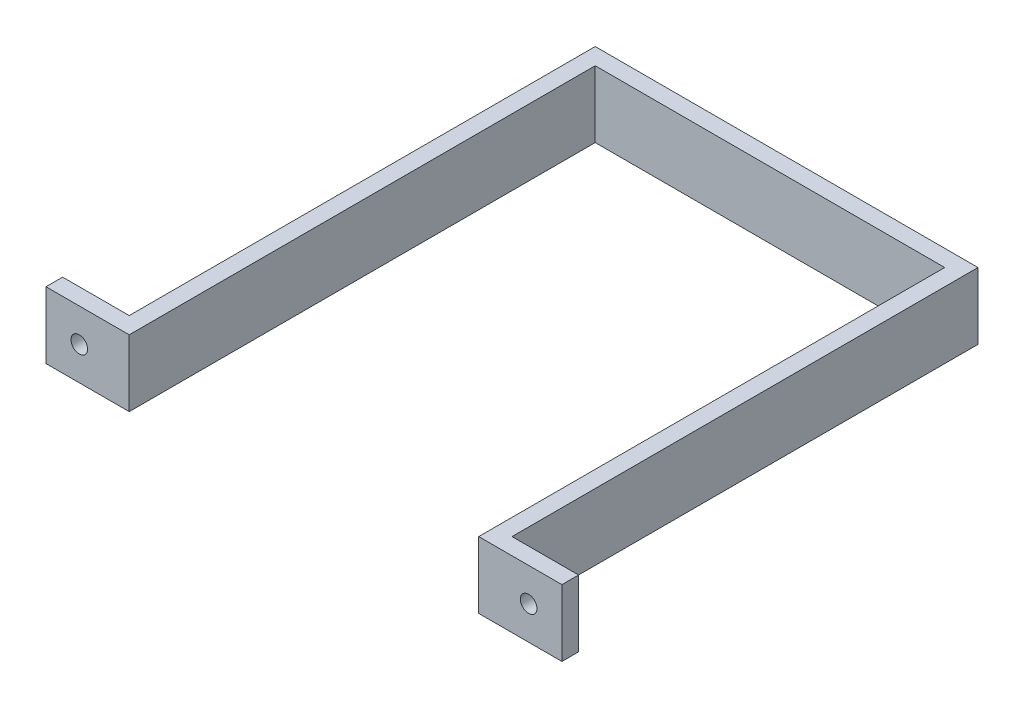
ISO-10303-21;
HEADER;
FILE_DESCRIPTION(('STEP AP214'),'2;1');
FILE_NAME('part.step','',(''),(''),'','','');
FILE_SCHEMA(('AUTOMOTIVE_DESIGN { 1 0 10303 214 1 1 1 1 }'));
ENDSEC;
DATA;
#1=APPLICATION_CONTEXT('core data for automotive mechanical design processes');
#2=APPLICATION_PROTOCOL_DEFINITION('international standard','automotive_design',2000,#1);
#3=PRODUCT_CONTEXT('',#1,'mechanical');
#4=PRODUCT('Part','Part','',(#3));
#5=PRODUCT_RELATED_PRODUCT_CATEGORY('part','',(#4));
#6=PRODUCT_DEFINITION_FORMATION('','',#4);
#7=PRODUCT_DEFINITION_CONTEXT('part definition',#1,'design');
#8=PRODUCT_DEFINITION('design','',#6,#7);
#9=PRODUCT_DEFINITION_SHAPE('','',#8);
#10=(LENGTH_UNIT() NAMED_UNIT(*) SI_UNIT(.MILLI.,.METRE.));
#11=(NAMED_UNIT(*) PLANE_ANGLE_UNIT() SI_UNIT($,.RADIAN.));
#12=(NAMED_UNIT(*) SI_UNIT($,.STERADIAN.) SOLID_ANGLE_UNIT());
#13=UNCERTAINTY_MEASURE_WITH_UNIT(LENGTH_MEASURE(1.E-05),#10,'distance_accuracy_value','');
#14=(GEOMETRIC_REPRESENTATION_CONTEXT(3) GLOBAL_UNCERTAINTY_ASSIGNED_CONTEXT((#13)) GLOBAL_UNIT_ASSIGNED_CONTEXT((#10,
#11,#12)) REPRESENTATION_CONTEXT('',''));
#15=CARTESIAN_POINT('',(0.,0.,0.));
#16=DIRECTION('',(0.,0.,1.));
#17=DIRECTION('',(1.,0.,0.));
#18=AXIS2_PLACEMENT_3D('',#15,#16,#17);
#19=CARTESIAN_POINT('',(0.,20.,70.));
#20=DIRECTION('',(0.,0.,-1.));
#21=DIRECTION('',(-1.,0.,0.));
#22=AXIS2_PLACEMENT_3D('',#19,#20,#21);
#23=PLANE('',#22);
#24=CARTESIAN_POINT('',(67.5,10.,70.));
#25=DIRECTION('',(0.,0.,-1.));
#26=DIRECTION('',(-1.,0.,0.));
#27=AXIS2_PLACEMENT_3D('',#24,#25,#26);
#28=CIRCLE('',#27,2.5);
#29=CARTESIAN_POINT('',(65.,10.,70.));
#30=VERTEX_POINT('',#29);
#31=EDGE_CURVE('E173',#30,#30,#28,.T.);
#32=ORIENTED_EDGE('',*,*,#31,.T.);
#33=EDGE_LOOP('',(#32));
#34=FACE_BOUND('',#33,.T.);
#35=DIRECTION('',(1.,0.,0.));
#36=VECTOR('',#35,1.);
#37=CARTESIAN_POINT('',(0.,0.,70.));
#38=LINE('',#37,#36);
#39=CARTESIAN_POINT('',(52.5,0.,70.));
#40=VERTEX_POINT('',#39);
#41=CARTESIAN_POINT('',(77.5,0.,70.));
#42=VERTEX_POINT('',#41);
#43=EDGE_CURVE('E168',#40,#42,#38,.T.);
#44=ORIENTED_EDGE('',*,*,#43,.T.);
#45=DIRECTION('',(0.,-1.,0.));
#46=VECTOR('',#45,1.);
#47=CARTESIAN_POINT('',(77.5,20.,70.));
#48=LINE('',#47,#46);
#49=CARTESIAN_POINT('',(77.5,20.,70.));
#50=VERTEX_POINT('',#49);
#51=EDGE_CURVE('E11',#50,#42,#48,.T.);
#52=ORIENTED_EDGE('',*,*,#51,.F.);
#53=DIRECTION('',(1.,0.,0.));
#54=VECTOR('',#53,1.);
#55=CARTESIAN_POINT('',(0.,20.,70.));
#56=LINE('',#55,#54);
#57=CARTESIAN_POINT('',(52.5,20.,70.));
#58=VERTEX_POINT('',#57);
#59=EDGE_CURVE('E211',#58,#50,#56,.T.);
#60=ORIENTED_EDGE('',*,*,#59,.F.);
#61=DIRECTION('',(0.,-1.,0.));
#62=VECTOR('',#61,1.);
#63=CARTESIAN_POINT('',(52.5,20.,70.));
#64=LINE('',#63,#62);
#65=EDGE_CURVE('E167',#58,#40,#64,.T.);
#66=ORIENTED_EDGE('',*,*,#65,.T.);
#67=EDGE_LOOP('',(#44,#52,#60,#66));
#68=FACE_BOUND('',#67,.T.);
#69=ADVANCED_FACE('F39',(#34,#68),#23,.F.);
#70=CARTESIAN_POINT('',(77.5,20.,0.));
#71=DIRECTION('',(-1.,0.,0.));
#72=DIRECTION('',(0.,0.,1.));
#73=AXIS2_PLACEMENT_3D('',#70,#71,#72);
#74=PLANE('',#73);
#75=DIRECTION('',(0.,0.,-1.));
#76=VECTOR('',#75,1.);
#77=CARTESIAN_POINT('',(77.5,0.,0.));
#78=LINE('',#77,#76);
#79=CARTESIAN_POINT('',(77.5,0.,65.));
#80=VERTEX_POINT('',#79);
#81=EDGE_CURVE('E172',#42,#80,#78,.T.);
#82=ORIENTED_EDGE('',*,*,#81,.T.);
#83=DIRECTION('',(0.,-1.,0.));
#84=VECTOR('',#83,1.);
#85=CARTESIAN_POINT('',(77.5,20.,65.));
#86=LINE('',#85,#84);
#87=CARTESIAN_POINT('',(77.5,20.,65.));
#88=VERTEX_POINT('',#87);
#89=EDGE_CURVE('E49',#88,#80,#86,.T.);
#90=ORIENTED_EDGE('',*,*,#89,.F.);
#91=DIRECTION('',(0.,0.,-1.));
#92=VECTOR('',#91,1.);
#93=CARTESIAN_POINT('',(77.5,20.,0.));
#94=LINE('',#93,#92);
#95=EDGE_CURVE('E111',#50,#88,#94,.T.);
#96=ORIENTED_EDGE('',*,*,#95,.F.);
#97=ORIENTED_EDGE('',*,*,#51,.T.);
#98=EDGE_LOOP('',(#82,#90,#96,#97));
#99=FACE_BOUND('',#98,.T.);
#100=ADVANCED_FACE('F243',(#99),#74,.F.);
#101=CARTESIAN_POINT('',(0.,20.,65.));
#102=DIRECTION('',(0.,0.,-1.));
#103=DIRECTION('',(-1.,0.,0.));
#104=AXIS2_PLACEMENT_3D('',#101,#102,#103);
#105=PLANE('',#104);
#106=CARTESIAN_POINT('',(67.5,10.,65.));
#107=DIRECTION('',(0.,0.,-1.));
#108=DIRECTION('',(-1.,0.,0.));
#109=AXIS2_PLACEMENT_3D('',#106,#107,#108);
#110=CIRCLE('',#109,2.5);
#111=CARTESIAN_POINT('',(65.,10.,65.));
#112=VERTEX_POINT('',#111);
#113=EDGE_CURVE('E309',#112,#112,#110,.T.);
#114=ORIENTED_EDGE('',*,*,#113,.F.);
#115=EDGE_LOOP('',(#114));
#116=FACE_BOUND('',#115,.T.);
#117=DIRECTION('',(1.,0.,0.));
#118=VECTOR('',#117,1.);
#119=CARTESIAN_POINT('',(0.,0.,65.));
#120=LINE('',#119,#118);
#121=CARTESIAN_POINT('',(57.5,0.,65.));
#122=VERTEX_POINT('',#121);
#123=EDGE_CURVE('E177',#122,#80,#120,.T.);
#124=ORIENTED_EDGE('',*,*,#123,.F.);
#125=DIRECTION('',(0.,-1.,0.));
#126=VECTOR('',#125,1.);
#127=CARTESIAN_POINT('',(57.5,20.,65.));
#128=LINE('',#127,#126);
#129=CARTESIAN_POINT('',(57.5,20.,65.));
#130=VERTEX_POINT('',#129);
#131=EDGE_CURVE('E233',#130,#122,#128,.T.);
#132=ORIENTED_EDGE('',*,*,#131,.F.);
#133=DIRECTION('',(1.,0.,0.));
#134=VECTOR('',#133,1.);
#135=CARTESIAN_POINT('',(0.,20.,65.));
#136=LINE('',#135,#134);
#137=EDGE_CURVE('E242',#130,#88,#136,.T.);
#138=ORIENTED_EDGE('',*,*,#137,.T.);
#139=ORIENTED_EDGE('',*,*,#89,.T.);
#140=EDGE_LOOP('',(#124,#132,#138,#139));
#141=FACE_BOUND('',#140,.T.);
#142=ADVANCED_FACE('F240',(#116,#141),#105,.T.);
#143=CARTESIAN_POINT('',(57.5,20.,0.));
#144=DIRECTION('',(-1.,0.,0.));
#145=DIRECTION('',(0.,0.,1.));
#146=AXIS2_PLACEMENT_3D('',#143,#144,#145);
#147=PLANE('',#146);
#148=DIRECTION('',(0.,0.,-1.));
#149=VECTOR('',#148,1.);
#150=CARTESIAN_POINT('',(57.5,0.,0.));
#151=LINE('',#150,#149);
#152=CARTESIAN_POINT('',(57.5,0.,-75.));
#153=VERTEX_POINT('',#152);
#154=EDGE_CURVE('E181',#122,#153,#151,.T.);
#155=ORIENTED_EDGE('',*,*,#154,.T.);
#156=DIRECTION('',(0.,-1.,0.));
#157=VECTOR('',#156,1.);
#158=CARTESIAN_POINT('',(57.5,20.,-75.));
#159=LINE('',#158,#157);
#160=CARTESIAN_POINT('',(57.5,20.,-75.));
#161=VERTEX_POINT('',#160);
#162=EDGE_CURVE('E230',#161,#153,#159,.T.);
#163=ORIENTED_EDGE('',*,*,#162,.F.);
#164=DIRECTION('',(0.,0.,-1.));
#165=VECTOR('',#164,1.);
#166=CARTESIAN_POINT('',(57.5,20.,0.));
#167=LINE('',#166,#165);
#168=EDGE_CURVE('E255',#130,#161,#167,.T.);
#169=ORIENTED_EDGE('',*,*,#168,.F.);
#170=ORIENTED_EDGE('',*,*,#131,.T.);
#171=EDGE_LOOP('',(#155,#163,#169,#170));
#172=FACE_BOUND('',#171,.T.);
#173=ADVANCED_FACE('F252',(#172),#147,.F.);
#174=CARTESIAN_POINT('',(0.,20.,-75.));
#175=DIRECTION('',(0.,0.,-1.));
#176=DIRECTION('',(-1.,0.,0.));
#177=AXIS2_PLACEMENT_3D('',#174,#175,#176);
#178=PLANE('',#177);
#179=DIRECTION('',(1.,0.,0.));
#180=VECTOR('',#179,1.);
#181=CARTESIAN_POINT('',(0.,0.,-75.));
#182=LINE('',#181,#180);
#183=CARTESIAN_POINT('',(-57.5,0.,-75.));
#184=VERTEX_POINT('',#183);
#185=EDGE_CURVE('E185',#184,#153,#182,.T.);
#186=ORIENTED_EDGE('',*,*,#185,.F.);
#187=DIRECTION('',(0.,-1.,0.));
#188=VECTOR('',#187,1.);
#189=CARTESIAN_POINT('',(-57.5,20.,-75.));
#190=LINE('',#189,#188);
#191=CARTESIAN_POINT('',(-57.5,20.,-75.));
#192=VERTEX_POINT('',#191);
#193=EDGE_CURVE('E227',#192,#184,#190,.T.);
#194=ORIENTED_EDGE('',*,*,#193,.F.);
#195=DIRECTION('',(1.,0.,0.));
#196=VECTOR('',#195,1.);
#197=CARTESIAN_POINT('',(0.,20.,-75.));
#198=LINE('',#197,#196);
#199=EDGE_CURVE('E258',#192,#161,#198,.T.);
#200=ORIENTED_EDGE('',*,*,#199,.T.);
#201=ORIENTED_EDGE('',*,*,#162,.T.);
#202=EDGE_LOOP('',(#186,#194,#200,#201));
#203=FACE_BOUND('',#202,.T.);
#204=ADVANCED_FACE('F327',(#203),#178,.T.);
#205=CARTESIAN_POINT('',(-57.5,20.,0.));
#206=DIRECTION('',(-1.,0.,0.));
#207=DIRECTION('',(0.,0.,1.));
#208=AXIS2_PLACEMENT_3D('',#205,#206,#207);
#209=PLANE('',#208);
#210=DIRECTION('',(0.,0.,-1.));
#211=VECTOR('',#210,1.);
#212=CARTESIAN_POINT('',(-57.5,0.,0.));
#213=LINE('',#212,#211);
#214=CARTESIAN_POINT('',(-57.5,0.,65.));
#215=VERTEX_POINT('',#214);
#216=EDGE_CURVE('E189',#215,#184,#213,.T.);
#217=ORIENTED_EDGE('',*,*,#216,.F.);
#218=DIRECTION('',(0.,-1.,0.));
#219=VECTOR('',#218,1.);
#220=CARTESIAN_POINT('',(-57.5,20.,65.));
#221=LINE('',#220,#219);
#222=CARTESIAN_POINT('',(-57.5,20.,65.));
#223=VERTEX_POINT('',#222);
#224=EDGE_CURVE('E224',#223,#215,#221,.T.);
#225=ORIENTED_EDGE('',*,*,#224,.F.);
#226=DIRECTION('',(0.,0.,-1.));
#227=VECTOR('',#226,1.);
#228=CARTESIAN_POINT('',(-57.5,20.,0.));
#229=LINE('',#228,#227);
#230=EDGE_CURVE('E268',#223,#192,#229,.T.);
#231=ORIENTED_EDGE('',*,*,#230,.T.);
#232=ORIENTED_EDGE('',*,*,#193,.T.);
#233=EDGE_LOOP('',(#217,#225,#231,#232));
#234=FACE_BOUND('',#233,.T.);
#235=ADVANCED_FACE('F332',(#234),#209,.T.);
#236=CARTESIAN_POINT('',(0.,20.,65.));
#237=DIRECTION('',(0.,0.,1.));
#238=DIRECTION('',(1.,0.,0.));
#239=AXIS2_PLACEMENT_3D('',#236,#237,#238);
#240=PLANE('',#239);
#241=CARTESIAN_POINT('',(-67.5,10.,65.));
#242=DIRECTION('',(0.,0.,-1.));
#243=DIRECTION('',(-1.,0.,0.));
#244=AXIS2_PLACEMENT_3D('',#241,#242,#243);
#245=CIRCLE('',#244,2.5);
#246=CARTESIAN_POINT('',(-70.,10.,65.));
#247=VERTEX_POINT('',#246);
#248=EDGE_CURVE('E311',#247,#247,#245,.T.);
#249=ORIENTED_EDGE('',*,*,#248,.F.);
#250=EDGE_LOOP('',(#249));
#251=FACE_BOUND('',#250,.T.);
#252=DIRECTION('',(-1.,0.,0.));
#253=VECTOR('',#252,1.);
#254=CARTESIAN_POINT('',(0.,0.,65.));
#255=LINE('',#254,#253);
#256=CARTESIAN_POINT('',(-77.5,0.,65.));
#257=VERTEX_POINT('',#256);
#258=EDGE_CURVE('E193',#215,#257,#255,.T.);
#259=ORIENTED_EDGE('',*,*,#258,.T.);
#260=DIRECTION('',(0.,-1.,0.));
#261=VECTOR('',#260,1.);
#262=CARTESIAN_POINT('',(-77.5,20.,65.));
#263=LINE('',#262,#261);
#264=CARTESIAN_POINT('',(-77.5,20.,65.));
#265=VERTEX_POINT('',#264);
#266=EDGE_CURVE('E221',#265,#257,#263,.T.);
#267=ORIENTED_EDGE('',*,*,#266,.F.);
#268=DIRECTION('',(-1.,0.,0.));
#269=VECTOR('',#268,1.);
#270=CARTESIAN_POINT('',(0.,20.,65.));
#271=LINE('',#270,#269);
#272=EDGE_CURVE('E272',#223,#265,#271,.T.);
#273=ORIENTED_EDGE('',*,*,#272,.F.);
#274=ORIENTED_EDGE('',*,*,#224,.T.);
#275=EDGE_LOOP('',(#259,#267,#273,#274));
#276=FACE_BOUND('',#275,.T.);
#277=ADVANCED_FACE('F336',(#251,#276),#240,.F.);
#278=CARTESIAN_POINT('',(-77.5,20.,0.));
#279=DIRECTION('',(-1.,0.,0.));
#280=DIRECTION('',(0.,0.,1.));
#281=AXIS2_PLACEMENT_3D('',#278,#279,#280);
#282=PLANE('',#281);
#283=DIRECTION('',(0.,0.,-1.));
#284=VECTOR('',#283,1.);
#285=CARTESIAN_POINT('',(-77.5,0.,0.));
#286=LINE('',#285,#284);
#287=CARTESIAN_POINT('',(-77.5,0.,70.));
#288=VERTEX_POINT('',#287);
#289=EDGE_CURVE('E197',#288,#257,#286,.T.);
#290=ORIENTED_EDGE('',*,*,#289,.F.);
#291=DIRECTION('',(0.,-1.,0.));
#292=VECTOR('',#291,1.);
#293=CARTESIAN_POINT('',(-77.5,20.,70.));
#294=LINE('',#293,#292);
#295=CARTESIAN_POINT('',(-77.5,20.,70.));
#296=VERTEX_POINT('',#295);
#297=EDGE_CURVE('E218',#296,#288,#294,.T.);
#298=ORIENTED_EDGE('',*,*,#297,.F.);
#299=DIRECTION('',(0.,0.,-1.));
#300=VECTOR('',#299,1.);
#301=CARTESIAN_POINT('',(-77.5,20.,0.));
#302=LINE('',#301,#300);
#303=EDGE_CURVE('E161',#296,#265,#302,.T.);
#304=ORIENTED_EDGE('',*,*,#303,.T.);
#305=ORIENTED_EDGE('',*,*,#266,.T.);
#306=EDGE_LOOP('',(#290,#298,#304,#305));
#307=FACE_BOUND('',#306,.T.);
#308=ADVANCED_FACE('F278',(#307),#282,.T.);
#309=CARTESIAN_POINT('',(0.,20.,70.));
#310=DIRECTION('',(0.,0.,1.));
#311=DIRECTION('',(1.,0.,0.));
#312=AXIS2_PLACEMENT_3D('',#309,#310,#311);
#313=PLANE('',#312);
#314=CARTESIAN_POINT('',(-67.5,10.,70.));
#315=DIRECTION('',(0.,0.,1.));
#316=DIRECTION('',(1.,0.,0.));
#317=AXIS2_PLACEMENT_3D('',#314,#315,#316);
#318=CIRCLE('',#317,2.5);
#319=CARTESIAN_POINT('',(-65.,10.,70.));
#320=VERTEX_POINT('',#319);
#321=EDGE_CURVE('E42',#320,#320,#318,.T.);
#322=ORIENTED_EDGE('',*,*,#321,.F.);
#323=EDGE_LOOP('',(#322));
#324=FACE_BOUND('',#323,.T.);
#325=DIRECTION('',(-1.,0.,0.));
#326=VECTOR('',#325,1.);
#327=CARTESIAN_POINT('',(0.,0.,70.));
#328=LINE('',#327,#326);
#329=CARTESIAN_POINT('',(-52.5,0.,70.));
#330=VERTEX_POINT('',#329);
#331=EDGE_CURVE('E201',#330,#288,#328,.T.);
#332=ORIENTED_EDGE('',*,*,#331,.F.);
#333=DIRECTION('',(0.,-1.,0.));
#334=VECTOR('',#333,1.);
#335=CARTESIAN_POINT('',(-52.5,20.,70.));
#336=LINE('',#335,#334);
#337=CARTESIAN_POINT('',(-52.5,20.,70.));
#338=VERTEX_POINT('',#337);
#339=EDGE_CURVE('E146',#338,#330,#336,.T.);
#340=ORIENTED_EDGE('',*,*,#339,.F.);
#341=DIRECTION('',(-1.,0.,0.));
#342=VECTOR('',#341,1.);
#343=CARTESIAN_POINT('',(0.,20.,70.));
#344=LINE('',#343,#342);
#345=EDGE_CURVE('E157',#338,#296,#344,.T.);
#346=ORIENTED_EDGE('',*,*,#345,.T.);
#347=ORIENTED_EDGE('',*,*,#297,.T.);
#348=EDGE_LOOP('',(#332,#340,#346,#347));
#349=FACE_BOUND('',#348,.T.);
#350=ADVANCED_FACE('F284',(#324,#349),#313,.T.);
#351=CARTESIAN_POINT('',(-52.5,20.,0.));
#352=DIRECTION('',(1.,0.,0.));
#353=DIRECTION('',(0.,0.,-1.));
#354=AXIS2_PLACEMENT_3D('',#351,#352,#353);
#355=PLANE('',#354);
#356=DIRECTION('',(0.,0.,1.));
#357=VECTOR('',#356,1.);
#358=CARTESIAN_POINT('',(-52.5,0.,0.));
#359=LINE('',#358,#357);
#360=CARTESIAN_POINT('',(-52.5,0.,-70.));
#361=VERTEX_POINT('',#360);
#362=EDGE_CURVE('E144',#361,#330,#359,.T.);
#363=ORIENTED_EDGE('',*,*,#362,.F.);
#364=DIRECTION('',(0.,-1.,0.));
#365=VECTOR('',#364,1.);
#366=CARTESIAN_POINT('',(-52.5,20.,-70.));
#367=LINE('',#366,#365);
#368=CARTESIAN_POINT('',(-52.5,20.,-70.));
#369=VERTEX_POINT('',#368);
#370=EDGE_CURVE('E138',#369,#361,#367,.T.);
#371=ORIENTED_EDGE('',*,*,#370,.F.);
#372=DIRECTION('',(0.,0.,1.));
#373=VECTOR('',#372,1.);
#374=CARTESIAN_POINT('',(-52.5,20.,0.));
#375=LINE('',#374,#373);
#376=EDGE_CURVE('E142',#369,#338,#375,.T.);
#377=ORIENTED_EDGE('',*,*,#376,.T.);
#378=ORIENTED_EDGE('',*,*,#339,.T.);
#379=EDGE_LOOP('',(#363,#371,#377,#378));
#380=FACE_BOUND('',#379,.T.);
#381=ADVANCED_FACE('F140',(#380),#355,.T.);
#382=CARTESIAN_POINT('',(0.,20.,-70.));
#383=DIRECTION('',(0.,0.,-1.));
#384=DIRECTION('',(-1.,0.,0.));
#385=AXIS2_PLACEMENT_3D('',#382,#383,#384);
#386=PLANE('',#385);
#387=DIRECTION('',(1.,0.,0.));
#388=VECTOR('',#387,1.);
#389=CARTESIAN_POINT('',(0.,0.,-70.));
#390=LINE('',#389,#388);
#391=CARTESIAN_POINT('',(52.5,0.,-70.));
#392=VERTEX_POINT('',#391);
#393=EDGE_CURVE('E97',#361,#392,#390,.T.);
#394=ORIENTED_EDGE('',*,*,#393,.T.);
#395=DIRECTION('',(0.,-1.,0.));
#396=VECTOR('',#395,1.);
#397=CARTESIAN_POINT('',(52.5,20.,-70.));
#398=LINE('',#397,#396);
#399=CARTESIAN_POINT('',(52.5,20.,-70.));
#400=VERTEX_POINT('',#399);
#401=EDGE_CURVE('E147',#400,#392,#398,.T.);
#402=ORIENTED_EDGE('',*,*,#401,.F.);
#403=DIRECTION('',(1.,0.,0.));
#404=VECTOR('',#403,1.);
#405=CARTESIAN_POINT('',(0.,20.,-70.));
#406=LINE('',#405,#404);
#407=EDGE_CURVE('E149',#369,#400,#406,.T.);
#408=ORIENTED_EDGE('',*,*,#407,.F.);
#409=ORIENTED_EDGE('',*,*,#370,.T.);
#410=EDGE_LOOP('',(#394,#402,#408,#409));
#411=FACE_BOUND('',#410,.T.);
#412=ADVANCED_FACE('F150',(#411),#386,.F.);
#413=CARTESIAN_POINT('',(52.5,20.,0.));
#414=DIRECTION('',(1.,0.,0.));
#415=DIRECTION('',(0.,0.,-1.));
#416=AXIS2_PLACEMENT_3D('',#413,#414,#415);
#417=PLANE('',#416);
#418=DIRECTION('',(0.,0.,1.));
#419=VECTOR('',#418,1.);
#420=CARTESIAN_POINT('',(52.5,0.,0.));
#421=LINE('',#420,#419);
#422=EDGE_CURVE('E103',#392,#40,#421,.T.);
#423=ORIENTED_EDGE('',*,*,#422,.T.);
#424=ORIENTED_EDGE('',*,*,#65,.F.);
#425=DIRECTION('',(0.,0.,1.));
#426=VECTOR('',#425,1.);
#427=CARTESIAN_POINT('',(52.5,20.,0.));
#428=LINE('',#427,#426);
#429=EDGE_CURVE('E57',#400,#58,#428,.T.);
#430=ORIENTED_EDGE('',*,*,#429,.F.);
#431=ORIENTED_EDGE('',*,*,#401,.T.);
#432=EDGE_LOOP('',(#423,#424,#430,#431));
#433=FACE_BOUND('',#432,.T.);
#434=ADVANCED_FACE('F287',(#433),#417,.F.);
#435=CARTESIAN_POINT('',(0.,20.,0.));
#436=DIRECTION('',(0.,1.,0.));
#437=DIRECTION('',(0.,0.,1.));
#438=AXIS2_PLACEMENT_3D('',#435,#436,#437);
#439=PLANE('',#438);
#440=ORIENTED_EDGE('',*,*,#59,.T.);
#441=ORIENTED_EDGE('',*,*,#95,.T.);
#442=ORIENTED_EDGE('',*,*,#137,.F.);
#443=ORIENTED_EDGE('',*,*,#168,.T.);
#444=ORIENTED_EDGE('',*,*,#199,.F.);
#445=ORIENTED_EDGE('',*,*,#230,.F.);
#446=ORIENTED_EDGE('',*,*,#272,.T.);
#447=ORIENTED_EDGE('',*,*,#303,.F.);
#448=ORIENTED_EDGE('',*,*,#345,.F.);
#449=ORIENTED_EDGE('',*,*,#376,.F.);
#450=ORIENTED_EDGE('',*,*,#407,.T.);
#451=ORIENTED_EDGE('',*,*,#429,.T.);
#452=EDGE_LOOP('',(#440,#441,#442,#443,#444,#445,#446,#447,#448,#449,#450,#451));
#453=FACE_BOUND('',#452,.T.);
#454=ADVANCED_FACE('F154',(#453),#439,.T.);
#455=CARTESIAN_POINT('',(0.,0.,0.));
#456=DIRECTION('',(0.,1.,0.));
#457=DIRECTION('',(0.,0.,1.));
#458=AXIS2_PLACEMENT_3D('',#455,#456,#457);
#459=PLANE('',#458);
#460=ORIENTED_EDGE('',*,*,#43,.F.);
#461=ORIENTED_EDGE('',*,*,#422,.F.);
#462=ORIENTED_EDGE('',*,*,#393,.F.);
#463=ORIENTED_EDGE('',*,*,#362,.T.);
#464=ORIENTED_EDGE('',*,*,#331,.T.);
#465=ORIENTED_EDGE('',*,*,#289,.T.);
#466=ORIENTED_EDGE('',*,*,#258,.F.);
#467=ORIENTED_EDGE('',*,*,#216,.T.);
#468=ORIENTED_EDGE('',*,*,#185,.T.);
#469=ORIENTED_EDGE('',*,*,#154,.F.);
#470=ORIENTED_EDGE('',*,*,#123,.T.);
#471=ORIENTED_EDGE('',*,*,#81,.F.);
#472=EDGE_LOOP('',(#460,#461,#462,#463,#464,#465,#466,#467,#468,#469,#470,#471));
#473=FACE_BOUND('',#472,.T.);
#474=ADVANCED_FACE('F248',(#473),#459,.F.);
#475=CARTESIAN_POINT('',(-67.5,10.,85.));
#476=DIRECTION('',(0.,0.,-1.));
#477=DIRECTION('',(-1.,0.,0.));
#478=AXIS2_PLACEMENT_3D('',#475,#476,#477);
#479=CYLINDRICAL_SURFACE('',#478,2.5);
#480=ORIENTED_EDGE('',*,*,#321,.T.);
#481=EDGE_LOOP('',(#480));
#482=FACE_BOUND('',#481,.T.);
#483=ORIENTED_EDGE('',*,*,#248,.T.);
#484=EDGE_LOOP('',(#483));
#485=FACE_BOUND('',#484,.T.);
#486=ADVANCED_FACE('F375',(#482,#485),#479,.F.);
#487=CARTESIAN_POINT('',(67.5,10.,85.));
#488=DIRECTION('',(0.,0.,-1.));
#489=DIRECTION('',(-1.,0.,0.));
#490=AXIS2_PLACEMENT_3D('',#487,#488,#489);
#491=CYLINDRICAL_SURFACE('',#490,2.5);
#492=ORIENTED_EDGE('',*,*,#113,.T.);
#493=EDGE_LOOP('',(#492));
#494=FACE_BOUND('',#493,.T.);
#495=ORIENTED_EDGE('',*,*,#31,.F.);
#496=EDGE_LOOP('',(#495));
#497=FACE_BOUND('',#496,.T.);
#498=ADVANCED_FACE('F320',(#494,#497),#491,.F.);
#499=CLOSED_SHELL('',(#69,#100,#142,#173,#204,#235,#277,#308,#350,#381,#412,#434,#454,#474,#486,#498));
#500=MANIFOLD_SOLID_BREP('B2',#499);
#501=ADVANCED_BREP_SHAPE_REPRESENTATION('',(#18,#500),#14);
#502=SHAPE_DEFINITION_REPRESENTATION(#9,#501);
ENDSEC;
END-ISO-10303-21;
